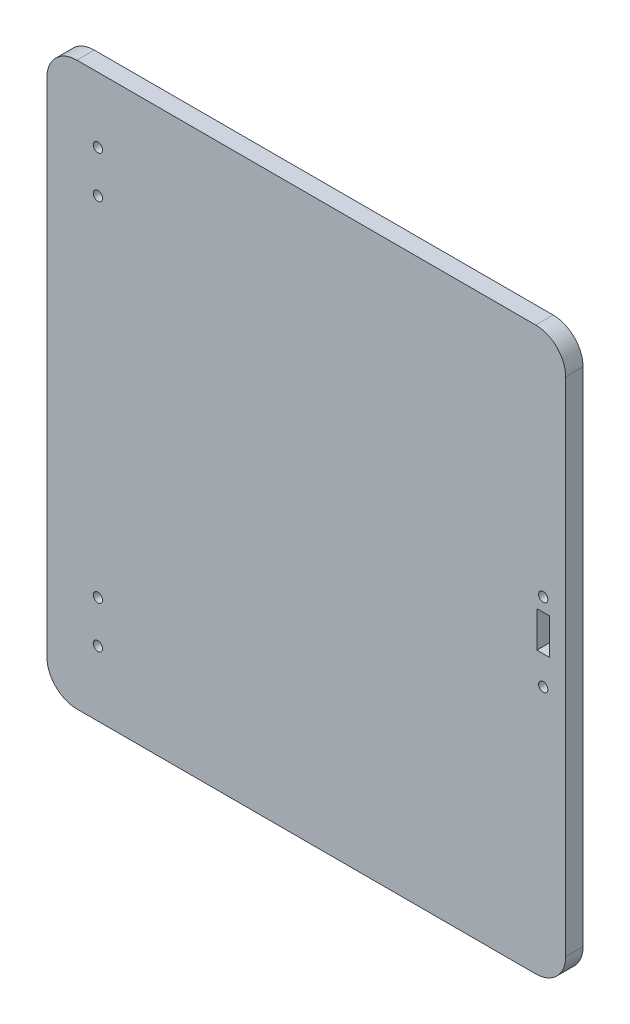
ISO-10303-21;
HEADER;
FILE_DESCRIPTION(('STEP AP214'),'2;1');
FILE_NAME('part.step','',(''),(''),'','','');
FILE_SCHEMA(('AUTOMOTIVE_DESIGN { 1 0 10303 214 1 1 1 1 }'));
ENDSEC;
DATA;
#1=APPLICATION_CONTEXT('core data for automotive mechanical design processes');
#2=APPLICATION_PROTOCOL_DEFINITION('international standard','automotive_design',2000,#1);
#3=PRODUCT_CONTEXT('',#1,'mechanical');
#4=PRODUCT('Part','Part','',(#3));
#5=PRODUCT_RELATED_PRODUCT_CATEGORY('part','',(#4));
#6=PRODUCT_DEFINITION_FORMATION('','',#4);
#7=PRODUCT_DEFINITION_CONTEXT('part definition',#1,'design');
#8=PRODUCT_DEFINITION('design','',#6,#7);
#9=PRODUCT_DEFINITION_SHAPE('','',#8);
#10=(LENGTH_UNIT() NAMED_UNIT(*) SI_UNIT(.MILLI.,.METRE.));
#11=(NAMED_UNIT(*) PLANE_ANGLE_UNIT() SI_UNIT($,.RADIAN.));
#12=(NAMED_UNIT(*) SI_UNIT($,.STERADIAN.) SOLID_ANGLE_UNIT());
#13=UNCERTAINTY_MEASURE_WITH_UNIT(LENGTH_MEASURE(1.E-05),#10,'distance_accuracy_value','');
#14=(GEOMETRIC_REPRESENTATION_CONTEXT(3) GLOBAL_UNCERTAINTY_ASSIGNED_CONTEXT((#13)) GLOBAL_UNIT_ASSIGNED_CONTEXT((#10,
#11,#12)) REPRESENTATION_CONTEXT('',''));
#15=CARTESIAN_POINT('',(0.,0.,0.));
#16=DIRECTION('',(0.,0.,1.));
#17=DIRECTION('',(1.,0.,0.));
#18=AXIS2_PLACEMENT_3D('',#15,#16,#17);
#19=CARTESIAN_POINT('',(76.5,83.7,5.8));
#20=DIRECTION('',(0.,0.,-1.));
#21=DIRECTION('',(-1.,0.,0.));
#22=AXIS2_PLACEMENT_3D('',#19,#20,#21);
#23=CYLINDRICAL_SURFACE('',#22,9.99999999999999);
#24=CARTESIAN_POINT('',(76.5,83.7,0.));
#25=DIRECTION('',(0.,0.,1.));
#26=DIRECTION('',(1.,0.,0.));
#27=AXIS2_PLACEMENT_3D('',#24,#25,#26);
#28=CIRCLE('',#27,9.99999999999999);
#29=CARTESIAN_POINT('',(86.5,83.7,0.));
#30=VERTEX_POINT('',#29);
#31=CARTESIAN_POINT('',(76.5,93.7,0.));
#32=VERTEX_POINT('',#31);
#33=EDGE_CURVE('E159',#30,#32,#28,.T.);
#34=ORIENTED_EDGE('',*,*,#33,.T.);
#35=DIRECTION('',(0.,0.,-1.));
#36=VECTOR('',#35,1.);
#37=CARTESIAN_POINT('',(76.5,93.7,5.8));
#38=LINE('',#37,#36);
#39=CARTESIAN_POINT('',(76.5,93.7,5.8));
#40=VERTEX_POINT('',#39);
#41=EDGE_CURVE('E241',#40,#32,#38,.T.);
#42=ORIENTED_EDGE('',*,*,#41,.F.);
#43=CARTESIAN_POINT('',(76.5,83.7,5.8));
#44=DIRECTION('',(0.,0.,1.));
#45=DIRECTION('',(1.,0.,0.));
#46=AXIS2_PLACEMENT_3D('',#43,#44,#45);
#47=CIRCLE('',#46,9.99999999999999);
#48=CARTESIAN_POINT('',(86.5,83.7,5.8));
#49=VERTEX_POINT('',#48);
#50=EDGE_CURVE('E164',#49,#40,#47,.T.);
#51=ORIENTED_EDGE('',*,*,#50,.F.);
#52=DIRECTION('',(0.,0.,-1.));
#53=VECTOR('',#52,1.);
#54=CARTESIAN_POINT('',(86.5,83.7,5.8));
#55=LINE('',#54,#53);
#56=EDGE_CURVE('E190',#49,#30,#55,.T.);
#57=ORIENTED_EDGE('',*,*,#56,.T.);
#58=EDGE_LOOP('',(#34,#42,#51,#57));
#59=FACE_BOUND('',#58,.T.);
#60=ADVANCED_FACE('F39',(#59),#23,.T.);
#61=CARTESIAN_POINT('',(76.5,93.7,5.8));
#62=DIRECTION('',(0.,-1.,0.));
#63=DIRECTION('',(0.,0.,-1.));
#64=AXIS2_PLACEMENT_3D('',#61,#62,#63);
#65=PLANE('',#64);
#66=DIRECTION('',(-1.,0.,0.));
#67=VECTOR('',#66,1.);
#68=CARTESIAN_POINT('',(76.5,93.7,0.));
#69=LINE('',#68,#67);
#70=CARTESIAN_POINT('',(-76.5,93.7,0.));
#71=VERTEX_POINT('',#70);
#72=EDGE_CURVE('E194',#32,#71,#69,.T.);
#73=ORIENTED_EDGE('',*,*,#72,.T.);
#74=DIRECTION('',(0.,0.,-1.));
#75=VECTOR('',#74,1.);
#76=CARTESIAN_POINT('',(-76.5,93.7,5.8));
#77=LINE('',#76,#75);
#78=CARTESIAN_POINT('',(-76.5,93.7,5.8));
#79=VERTEX_POINT('',#78);
#80=EDGE_CURVE('E237',#79,#71,#77,.T.);
#81=ORIENTED_EDGE('',*,*,#80,.F.);
#82=DIRECTION('',(-1.,0.,0.));
#83=VECTOR('',#82,1.);
#84=CARTESIAN_POINT('',(76.5,93.7,5.8));
#85=LINE('',#84,#83);
#86=EDGE_CURVE('E168',#40,#79,#85,.T.);
#87=ORIENTED_EDGE('',*,*,#86,.F.);
#88=ORIENTED_EDGE('',*,*,#41,.T.);
#89=EDGE_LOOP('',(#73,#81,#87,#88));
#90=FACE_BOUND('',#89,.T.);
#91=ADVANCED_FACE('F270',(#90),#65,.F.);
#92=CARTESIAN_POINT('',(-76.5,83.7,5.8));
#93=DIRECTION('',(0.,0.,-1.));
#94=DIRECTION('',(-1.,0.,0.));
#95=AXIS2_PLACEMENT_3D('',#92,#93,#94);
#96=CYLINDRICAL_SURFACE('',#95,9.99999999999999);
#97=CARTESIAN_POINT('',(-76.5,83.7,0.));
#98=DIRECTION('',(0.,0.,1.));
#99=DIRECTION('',(1.,0.,0.));
#100=AXIS2_PLACEMENT_3D('',#97,#98,#99);
#101=CIRCLE('',#100,9.99999999999999);
#102=CARTESIAN_POINT('',(-86.5,83.7,0.));
#103=VERTEX_POINT('',#102);
#104=EDGE_CURVE('E197',#71,#103,#101,.T.);
#105=ORIENTED_EDGE('',*,*,#104,.T.);
#106=DIRECTION('',(0.,0.,-1.));
#107=VECTOR('',#106,1.);
#108=CARTESIAN_POINT('',(-86.5,83.7,5.8));
#109=LINE('',#108,#107);
#110=CARTESIAN_POINT('',(-86.5,83.7,5.8));
#111=VERTEX_POINT('',#110);
#112=EDGE_CURVE('E233',#111,#103,#109,.T.);
#113=ORIENTED_EDGE('',*,*,#112,.F.);
#114=CARTESIAN_POINT('',(-76.5,83.7,5.8));
#115=DIRECTION('',(0.,0.,1.));
#116=DIRECTION('',(1.,0.,0.));
#117=AXIS2_PLACEMENT_3D('',#114,#115,#116);
#118=CIRCLE('',#117,9.99999999999999);
#119=EDGE_CURVE('E172',#79,#111,#118,.T.);
#120=ORIENTED_EDGE('',*,*,#119,.F.);
#121=ORIENTED_EDGE('',*,*,#80,.T.);
#122=EDGE_LOOP('',(#105,#113,#120,#121));
#123=FACE_BOUND('',#122,.T.);
#124=ADVANCED_FACE('F275',(#123),#96,.T.);
#125=CARTESIAN_POINT('',(-86.5,83.7,5.8));
#126=DIRECTION('',(1.,0.,0.));
#127=DIRECTION('',(0.,0.,-1.));
#128=AXIS2_PLACEMENT_3D('',#125,#126,#127);
#129=PLANE('',#128);
#130=DIRECTION('',(0.,-1.,0.));
#131=VECTOR('',#130,1.);
#132=CARTESIAN_POINT('',(-86.5,83.7,0.));
#133=LINE('',#132,#131);
#134=CARTESIAN_POINT('',(-86.5,-83.7,0.));
#135=VERTEX_POINT('',#134);
#136=EDGE_CURVE('E200',#103,#135,#133,.T.);
#137=ORIENTED_EDGE('',*,*,#136,.T.);
#138=DIRECTION('',(0.,0.,-1.));
#139=VECTOR('',#138,1.);
#140=CARTESIAN_POINT('',(-86.5,-83.7,5.8));
#141=LINE('',#140,#139);
#142=CARTESIAN_POINT('',(-86.5,-83.7,5.8));
#143=VERTEX_POINT('',#142);
#144=EDGE_CURVE('E229',#143,#135,#141,.T.);
#145=ORIENTED_EDGE('',*,*,#144,.F.);
#146=DIRECTION('',(0.,-1.,0.));
#147=VECTOR('',#146,1.);
#148=CARTESIAN_POINT('',(-86.5,83.7,5.8));
#149=LINE('',#148,#147);
#150=EDGE_CURVE('E175',#111,#143,#149,.T.);
#151=ORIENTED_EDGE('',*,*,#150,.F.);
#152=ORIENTED_EDGE('',*,*,#112,.T.);
#153=EDGE_LOOP('',(#137,#145,#151,#152));
#154=FACE_BOUND('',#153,.T.);
#155=ADVANCED_FACE('F307',(#154),#129,.F.);
#156=CARTESIAN_POINT('',(-76.5,-83.7,5.8));
#157=DIRECTION('',(0.,0.,-1.));
#158=DIRECTION('',(-1.,0.,0.));
#159=AXIS2_PLACEMENT_3D('',#156,#157,#158);
#160=CYLINDRICAL_SURFACE('',#159,9.99999999999999);
#161=CARTESIAN_POINT('',(-76.5,-83.7,0.));
#162=DIRECTION('',(0.,0.,1.));
#163=DIRECTION('',(1.,0.,0.));
#164=AXIS2_PLACEMENT_3D('',#161,#162,#163);
#165=CIRCLE('',#164,9.99999999999999);
#166=CARTESIAN_POINT('',(-76.5,-93.7,0.));
#167=VERTEX_POINT('',#166);
#168=EDGE_CURVE('E203',#135,#167,#165,.T.);
#169=ORIENTED_EDGE('',*,*,#168,.T.);
#170=DIRECTION('',(0.,0.,-1.));
#171=VECTOR('',#170,1.);
#172=CARTESIAN_POINT('',(-76.5,-93.7,5.8));
#173=LINE('',#172,#171);
#174=CARTESIAN_POINT('',(-76.5,-93.7,5.8));
#175=VERTEX_POINT('',#174);
#176=EDGE_CURVE('E225',#175,#167,#173,.T.);
#177=ORIENTED_EDGE('',*,*,#176,.F.);
#178=CARTESIAN_POINT('',(-76.5,-83.7,5.8));
#179=DIRECTION('',(0.,0.,1.));
#180=DIRECTION('',(1.,0.,0.));
#181=AXIS2_PLACEMENT_3D('',#178,#179,#180);
#182=CIRCLE('',#181,9.99999999999999);
#183=EDGE_CURVE('E178',#143,#175,#182,.T.);
#184=ORIENTED_EDGE('',*,*,#183,.F.);
#185=ORIENTED_EDGE('',*,*,#144,.T.);
#186=EDGE_LOOP('',(#169,#177,#184,#185));
#187=FACE_BOUND('',#186,.T.);
#188=ADVANCED_FACE('F303',(#187),#160,.T.);
#189=CARTESIAN_POINT('',(76.5,-93.7,5.8));
#190=DIRECTION('',(0.,1.,0.));
#191=DIRECTION('',(0.,0.,1.));
#192=AXIS2_PLACEMENT_3D('',#189,#190,#191);
#193=PLANE('',#192);
#194=DIRECTION('',(1.,0.,0.));
#195=VECTOR('',#194,1.);
#196=CARTESIAN_POINT('',(76.5,-93.7,0.));
#197=LINE('',#196,#195);
#198=CARTESIAN_POINT('',(76.5,-93.7,0.));
#199=VERTEX_POINT('',#198);
#200=EDGE_CURVE('E206',#167,#199,#197,.T.);
#201=ORIENTED_EDGE('',*,*,#200,.T.);
#202=DIRECTION('',(0.,0.,-1.));
#203=VECTOR('',#202,1.);
#204=CARTESIAN_POINT('',(76.5,-93.7,5.8));
#205=LINE('',#204,#203);
#206=CARTESIAN_POINT('',(76.5,-93.7,5.8));
#207=VERTEX_POINT('',#206);
#208=EDGE_CURVE('E221',#207,#199,#205,.T.);
#209=ORIENTED_EDGE('',*,*,#208,.F.);
#210=DIRECTION('',(1.,0.,0.));
#211=VECTOR('',#210,1.);
#212=CARTESIAN_POINT('',(76.5,-93.7,5.8));
#213=LINE('',#212,#211);
#214=EDGE_CURVE('E181',#175,#207,#213,.T.);
#215=ORIENTED_EDGE('',*,*,#214,.F.);
#216=ORIENTED_EDGE('',*,*,#176,.T.);
#217=EDGE_LOOP('',(#201,#209,#215,#216));
#218=FACE_BOUND('',#217,.T.);
#219=ADVANCED_FACE('F298',(#218),#193,.F.);
#220=CARTESIAN_POINT('',(76.5,-83.7,5.8));
#221=DIRECTION('',(0.,0.,-1.));
#222=DIRECTION('',(-1.,0.,0.));
#223=AXIS2_PLACEMENT_3D('',#220,#221,#222);
#224=CYLINDRICAL_SURFACE('',#223,9.99999999999999);
#225=CARTESIAN_POINT('',(76.5,-83.7,0.));
#226=DIRECTION('',(0.,0.,1.));
#227=DIRECTION('',(1.,0.,0.));
#228=AXIS2_PLACEMENT_3D('',#225,#226,#227);
#229=CIRCLE('',#228,9.99999999999999);
#230=CARTESIAN_POINT('',(86.5,-83.7,0.));
#231=VERTEX_POINT('',#230);
#232=EDGE_CURVE('E209',#199,#231,#229,.T.);
#233=ORIENTED_EDGE('',*,*,#232,.T.);
#234=DIRECTION('',(0.,0.,-1.));
#235=VECTOR('',#234,1.);
#236=CARTESIAN_POINT('',(86.5,-83.7,5.8));
#237=LINE('',#236,#235);
#238=CARTESIAN_POINT('',(86.5,-83.7,5.8));
#239=VERTEX_POINT('',#238);
#240=EDGE_CURVE('E217',#239,#231,#237,.T.);
#241=ORIENTED_EDGE('',*,*,#240,.F.);
#242=CARTESIAN_POINT('',(76.5,-83.7,5.8));
#243=DIRECTION('',(0.,0.,1.));
#244=DIRECTION('',(1.,0.,0.));
#245=AXIS2_PLACEMENT_3D('',#242,#243,#244);
#246=CIRCLE('',#245,9.99999999999999);
#247=EDGE_CURVE('E184',#207,#239,#246,.T.);
#248=ORIENTED_EDGE('',*,*,#247,.F.);
#249=ORIENTED_EDGE('',*,*,#208,.T.);
#250=EDGE_LOOP('',(#233,#241,#248,#249));
#251=FACE_BOUND('',#250,.T.);
#252=ADVANCED_FACE('F293',(#251),#224,.T.);
#253=CARTESIAN_POINT('',(86.5,83.7,5.8));
#254=DIRECTION('',(-1.,0.,0.));
#255=DIRECTION('',(0.,0.,1.));
#256=AXIS2_PLACEMENT_3D('',#253,#254,#255);
#257=PLANE('',#256);
#258=DIRECTION('',(0.,1.,0.));
#259=VECTOR('',#258,1.);
#260=CARTESIAN_POINT('',(86.5,83.7,0.));
#261=LINE('',#260,#259);
#262=EDGE_CURVE('E169',#231,#30,#261,.T.);
#263=ORIENTED_EDGE('',*,*,#262,.T.);
#264=ORIENTED_EDGE('',*,*,#56,.F.);
#265=DIRECTION('',(0.,1.,0.));
#266=VECTOR('',#265,1.);
#267=CARTESIAN_POINT('',(86.5,83.7,5.8));
#268=LINE('',#267,#266);
#269=EDGE_CURVE('E187',#239,#49,#268,.T.);
#270=ORIENTED_EDGE('',*,*,#269,.F.);
#271=ORIENTED_EDGE('',*,*,#240,.T.);
#272=EDGE_LOOP('',(#263,#264,#270,#271));
#273=FACE_BOUND('',#272,.T.);
#274=ADVANCED_FACE('F291',(#273),#257,.F.);
#275=CARTESIAN_POINT('',(76.5,83.7,5.8));
#276=DIRECTION('',(0.,0.,1.));
#277=DIRECTION('',(1.,0.,0.));
#278=AXIS2_PLACEMENT_3D('',#275,#276,#277);
#279=PLANE('',#278);
#280=CARTESIAN_POINT('',(79.,16.45,5.8));
#281=DIRECTION('',(0.,0.,1.));
#282=DIRECTION('',(1.,0.,0.));
#283=AXIS2_PLACEMENT_3D('',#280,#281,#282);
#284=CIRCLE('',#283,1.54999999999999);
#285=CARTESIAN_POINT('',(80.55,16.45,5.8));
#286=VERTEX_POINT('',#285);
#287=EDGE_CURVE('E331',#286,#286,#284,.T.);
#288=ORIENTED_EDGE('',*,*,#287,.F.);
#289=EDGE_LOOP('',(#288));
#290=FACE_BOUND('',#289,.T.);
#291=CARTESIAN_POINT('',(79.,-9.55,5.8));
#292=DIRECTION('',(0.,0.,1.));
#293=DIRECTION('',(1.,0.,0.));
#294=AXIS2_PLACEMENT_3D('',#291,#292,#293);
#295=CIRCLE('',#294,1.54999999999999);
#296=CARTESIAN_POINT('',(80.55,-9.55,5.8));
#297=VERTEX_POINT('',#296);
#298=EDGE_CURVE('E335',#297,#297,#295,.T.);
#299=ORIENTED_EDGE('',*,*,#298,.F.);
#300=EDGE_LOOP('',(#299));
#301=FACE_BOUND('',#300,.T.);
#302=CARTESIAN_POINT('',(-69.5,72.,5.8));
#303=DIRECTION('',(0.,0.,1.));
#304=DIRECTION('',(1.,0.,0.));
#305=AXIS2_PLACEMENT_3D('',#302,#303,#304);
#306=CIRCLE('',#305,1.54999999999999);
#307=CARTESIAN_POINT('',(-67.95,72.,5.8));
#308=VERTEX_POINT('',#307);
#309=EDGE_CURVE('E339',#308,#308,#306,.T.);
#310=ORIENTED_EDGE('',*,*,#309,.F.);
#311=EDGE_LOOP('',(#310));
#312=FACE_BOUND('',#311,.T.);
#313=CARTESIAN_POINT('',(-69.5,58.,5.8));
#314=DIRECTION('',(0.,0.,1.));
#315=DIRECTION('',(1.,0.,0.));
#316=AXIS2_PLACEMENT_3D('',#313,#314,#315);
#317=CIRCLE('',#316,1.54999999999999);
#318=CARTESIAN_POINT('',(-67.95,58.,5.8));
#319=VERTEX_POINT('',#318);
#320=EDGE_CURVE('E343',#319,#319,#317,.T.);
#321=ORIENTED_EDGE('',*,*,#320,.F.);
#322=EDGE_LOOP('',(#321));
#323=FACE_BOUND('',#322,.T.);
#324=CARTESIAN_POINT('',(-69.5,-58.,5.8));
#325=DIRECTION('',(0.,0.,1.));
#326=DIRECTION('',(-1.,0.,0.));
#327=AXIS2_PLACEMENT_3D('',#324,#325,#326);
#328=CIRCLE('',#327,1.54999999999999);
#329=CARTESIAN_POINT('',(-71.05,-58.,5.8));
#330=VERTEX_POINT('',#329);
#331=EDGE_CURVE('E347',#330,#330,#328,.T.);
#332=ORIENTED_EDGE('',*,*,#331,.F.);
#333=EDGE_LOOP('',(#332));
#334=FACE_BOUND('',#333,.T.);
#335=CARTESIAN_POINT('',(-69.5,-72.,5.8));
#336=DIRECTION('',(0.,0.,1.));
#337=DIRECTION('',(-1.,0.,0.));
#338=AXIS2_PLACEMENT_3D('',#335,#336,#337);
#339=CIRCLE('',#338,1.54999999999999);
#340=CARTESIAN_POINT('',(-71.05,-72.,5.8));
#341=VERTEX_POINT('',#340);
#342=EDGE_CURVE('E350',#341,#341,#339,.T.);
#343=ORIENTED_EDGE('',*,*,#342,.F.);
#344=EDGE_LOOP('',(#343));
#345=FACE_BOUND('',#344,.T.);
#346=DIRECTION('',(0.,1.,0.));
#347=VECTOR('',#346,1.);
#348=CARTESIAN_POINT('',(81.1,0.,5.8));
#349=LINE('',#348,#347);
#350=CARTESIAN_POINT('',(81.1,0.,5.8));
#351=VERTEX_POINT('',#350);
#352=CARTESIAN_POINT('',(81.1,12.,5.8));
#353=VERTEX_POINT('',#352);
#354=EDGE_CURVE('E54',#351,#353,#349,.T.);
#355=ORIENTED_EDGE('',*,*,#354,.F.);
#356=DIRECTION('',(1.,0.,0.));
#357=VECTOR('',#356,1.);
#358=CARTESIAN_POINT('',(81.1,0.,5.8));
#359=LINE('',#358,#357);
#360=CARTESIAN_POINT('',(76.9,0.,5.8));
#361=VERTEX_POINT('',#360);
#362=EDGE_CURVE('E149',#361,#351,#359,.T.);
#363=ORIENTED_EDGE('',*,*,#362,.F.);
#364=DIRECTION('',(0.,-1.,0.));
#365=VECTOR('',#364,1.);
#366=CARTESIAN_POINT('',(76.9,0.,5.8));
#367=LINE('',#366,#365);
#368=CARTESIAN_POINT('',(76.9,12.,5.8));
#369=VERTEX_POINT('',#368);
#370=EDGE_CURVE('E131',#369,#361,#367,.T.);
#371=ORIENTED_EDGE('',*,*,#370,.F.);
#372=DIRECTION('',(-1.,0.,0.));
#373=VECTOR('',#372,1.);
#374=CARTESIAN_POINT('',(81.1,12.,5.8));
#375=LINE('',#374,#373);
#376=EDGE_CURVE('E141',#353,#369,#375,.T.);
#377=ORIENTED_EDGE('',*,*,#376,.F.);
#378=EDGE_LOOP('',(#355,#363,#371,#377));
#379=FACE_BOUND('',#378,.T.);
#380=ORIENTED_EDGE('',*,*,#50,.T.);
#381=ORIENTED_EDGE('',*,*,#86,.T.);
#382=ORIENTED_EDGE('',*,*,#119,.T.);
#383=ORIENTED_EDGE('',*,*,#150,.T.);
#384=ORIENTED_EDGE('',*,*,#183,.T.);
#385=ORIENTED_EDGE('',*,*,#214,.T.);
#386=ORIENTED_EDGE('',*,*,#247,.T.);
#387=ORIENTED_EDGE('',*,*,#269,.T.);
#388=EDGE_LOOP('',(#380,#381,#382,#383,#384,#385,#386,#387));
#389=FACE_BOUND('',#388,.T.);
#390=ADVANCED_FACE('F146',(#290,#301,#312,#323,#334,#345,#379,#389),#279,.T.);
#391=CARTESIAN_POINT('',(76.5,83.7,0.));
#392=DIRECTION('',(0.,0.,1.));
#393=DIRECTION('',(1.,0.,0.));
#394=AXIS2_PLACEMENT_3D('',#391,#392,#393);
#395=PLANE('',#394);
#396=CARTESIAN_POINT('',(79.,16.45,0.));
#397=DIRECTION('',(0.,0.,1.));
#398=DIRECTION('',(1.,0.,0.));
#399=AXIS2_PLACEMENT_3D('',#396,#397,#398);
#400=CIRCLE('',#399,1.54999999999999);
#401=CARTESIAN_POINT('',(80.55,16.45,0.));
#402=VERTEX_POINT('',#401);
#403=EDGE_CURVE('E354',#402,#402,#400,.T.);
#404=ORIENTED_EDGE('',*,*,#403,.T.);
#405=EDGE_LOOP('',(#404));
#406=FACE_BOUND('',#405,.T.);
#407=CARTESIAN_POINT('',(79.,-9.55,0.));
#408=DIRECTION('',(0.,0.,1.));
#409=DIRECTION('',(1.,0.,0.));
#410=AXIS2_PLACEMENT_3D('',#407,#408,#409);
#411=CIRCLE('',#410,1.54999999999999);
#412=CARTESIAN_POINT('',(80.55,-9.55,0.));
#413=VERTEX_POINT('',#412);
#414=EDGE_CURVE('E471',#413,#413,#411,.T.);
#415=ORIENTED_EDGE('',*,*,#414,.T.);
#416=EDGE_LOOP('',(#415));
#417=FACE_BOUND('',#416,.T.);
#418=CARTESIAN_POINT('',(-69.5,72.,0.));
#419=DIRECTION('',(0.,0.,1.));
#420=DIRECTION('',(1.,0.,0.));
#421=AXIS2_PLACEMENT_3D('',#418,#419,#420);
#422=CIRCLE('',#421,1.54999999999999);
#423=CARTESIAN_POINT('',(-67.95,72.,0.));
#424=VERTEX_POINT('',#423);
#425=EDGE_CURVE('E364',#424,#424,#422,.T.);
#426=ORIENTED_EDGE('',*,*,#425,.T.);
#427=EDGE_LOOP('',(#426));
#428=FACE_BOUND('',#427,.T.);
#429=CARTESIAN_POINT('',(-69.5,58.,0.));
#430=DIRECTION('',(0.,0.,1.));
#431=DIRECTION('',(1.,0.,0.));
#432=AXIS2_PLACEMENT_3D('',#429,#430,#431);
#433=CIRCLE('',#432,1.54999999999999);
#434=CARTESIAN_POINT('',(-67.95,58.,0.));
#435=VERTEX_POINT('',#434);
#436=EDGE_CURVE('E371',#435,#435,#433,.T.);
#437=ORIENTED_EDGE('',*,*,#436,.T.);
#438=EDGE_LOOP('',(#437));
#439=FACE_BOUND('',#438,.T.);
#440=CARTESIAN_POINT('',(-69.5,-58.,0.));
#441=DIRECTION('',(0.,0.,1.));
#442=DIRECTION('',(-1.,0.,0.));
#443=AXIS2_PLACEMENT_3D('',#440,#441,#442);
#444=CIRCLE('',#443,1.54999999999999);
#445=CARTESIAN_POINT('',(-71.05,-58.,0.));
#446=VERTEX_POINT('',#445);
#447=EDGE_CURVE('E381',#446,#446,#444,.T.);
#448=ORIENTED_EDGE('',*,*,#447,.T.);
#449=EDGE_LOOP('',(#448));
#450=FACE_BOUND('',#449,.T.);
#451=CARTESIAN_POINT('',(-69.5,-72.,0.));
#452=DIRECTION('',(0.,0.,1.));
#453=DIRECTION('',(-1.,0.,0.));
#454=AXIS2_PLACEMENT_3D('',#451,#452,#453);
#455=CIRCLE('',#454,1.54999999999999);
#456=CARTESIAN_POINT('',(-71.05,-72.,0.));
#457=VERTEX_POINT('',#456);
#458=EDGE_CURVE('E353',#457,#457,#455,.T.);
#459=ORIENTED_EDGE('',*,*,#458,.T.);
#460=EDGE_LOOP('',(#459));
#461=FACE_BOUND('',#460,.T.);
#462=DIRECTION('',(1.,0.,0.));
#463=VECTOR('',#462,1.);
#464=CARTESIAN_POINT('',(76.5,0.,0.));
#465=LINE('',#464,#463);
#466=CARTESIAN_POINT('',(76.9,0.,0.));
#467=VERTEX_POINT('',#466);
#468=CARTESIAN_POINT('',(81.1,0.,0.));
#469=VERTEX_POINT('',#468);
#470=EDGE_CURVE('E47',#467,#469,#465,.T.);
#471=ORIENTED_EDGE('',*,*,#470,.T.);
#472=DIRECTION('',(0.,1.,0.));
#473=VECTOR('',#472,1.);
#474=CARTESIAN_POINT('',(81.1000000000002,83.7,0.));
#475=LINE('',#474,#473);
#476=CARTESIAN_POINT('',(81.1,12.,0.));
#477=VERTEX_POINT('',#476);
#478=EDGE_CURVE('E11',#469,#477,#475,.T.);
#479=ORIENTED_EDGE('',*,*,#478,.T.);
#480=DIRECTION('',(-1.,0.,0.));
#481=VECTOR('',#480,1.);
#482=CARTESIAN_POINT('',(76.5,12.,0.));
#483=LINE('',#482,#481);
#484=CARTESIAN_POINT('',(76.9,12.,0.));
#485=VERTEX_POINT('',#484);
#486=EDGE_CURVE('E245',#477,#485,#483,.T.);
#487=ORIENTED_EDGE('',*,*,#486,.T.);
#488=DIRECTION('',(0.,-1.,0.));
#489=VECTOR('',#488,1.);
#490=CARTESIAN_POINT('',(76.9,83.7,0.));
#491=LINE('',#490,#489);
#492=EDGE_CURVE('E134',#485,#467,#491,.T.);
#493=ORIENTED_EDGE('',*,*,#492,.T.);
#494=EDGE_LOOP('',(#471,#479,#487,#493));
#495=FACE_BOUND('',#494,.T.);
#496=ORIENTED_EDGE('',*,*,#33,.F.);
#497=ORIENTED_EDGE('',*,*,#262,.F.);
#498=ORIENTED_EDGE('',*,*,#232,.F.);
#499=ORIENTED_EDGE('',*,*,#200,.F.);
#500=ORIENTED_EDGE('',*,*,#168,.F.);
#501=ORIENTED_EDGE('',*,*,#136,.F.);
#502=ORIENTED_EDGE('',*,*,#104,.F.);
#503=ORIENTED_EDGE('',*,*,#72,.F.);
#504=EDGE_LOOP('',(#496,#497,#498,#499,#500,#501,#502,#503));
#505=FACE_BOUND('',#504,.T.);
#506=ADVANCED_FACE('F252',(#406,#417,#428,#439,#450,#461,#495,#505),#395,.F.);
#507=CARTESIAN_POINT('',(81.1,0.,-0.55));
#508=DIRECTION('',(1.,0.,0.));
#509=DIRECTION('',(0.,1.,0.));
#510=AXIS2_PLACEMENT_3D('',#507,#508,#509);
#511=PLANE('',#510);
#512=DIRECTION('',(0.,0.,1.));
#513=VECTOR('',#512,1.);
#514=CARTESIAN_POINT('',(81.1,0.,-0.55));
#515=LINE('',#514,#513);
#516=EDGE_CURVE('E156',#469,#351,#515,.T.);
#517=ORIENTED_EDGE('',*,*,#516,.T.);
#518=ORIENTED_EDGE('',*,*,#354,.T.);
#519=DIRECTION('',(0.,0.,1.));
#520=VECTOR('',#519,1.);
#521=CARTESIAN_POINT('',(81.1,12.,-0.55));
#522=LINE('',#521,#520);
#523=EDGE_CURVE('E138',#477,#353,#522,.T.);
#524=ORIENTED_EDGE('',*,*,#523,.F.);
#525=ORIENTED_EDGE('',*,*,#478,.F.);
#526=EDGE_LOOP('',(#517,#518,#524,#525));
#527=FACE_BOUND('',#526,.T.);
#528=ADVANCED_FACE('F257',(#527),#511,.F.);
#529=CARTESIAN_POINT('',(81.1,0.,-0.55));
#530=DIRECTION('',(0.,-1.,0.));
#531=DIRECTION('',(1.,0.,0.));
#532=AXIS2_PLACEMENT_3D('',#529,#530,#531);
#533=PLANE('',#532);
#534=DIRECTION('',(0.,0.,1.));
#535=VECTOR('',#534,1.);
#536=CARTESIAN_POINT('',(76.9,0.,-0.55));
#537=LINE('',#536,#535);
#538=EDGE_CURVE('E137',#467,#361,#537,.T.);
#539=ORIENTED_EDGE('',*,*,#538,.T.);
#540=ORIENTED_EDGE('',*,*,#362,.T.);
#541=ORIENTED_EDGE('',*,*,#516,.F.);
#542=ORIENTED_EDGE('',*,*,#470,.F.);
#543=EDGE_LOOP('',(#539,#540,#541,#542));
#544=FACE_BOUND('',#543,.T.);
#545=ADVANCED_FACE('F256',(#544),#533,.F.);
#546=CARTESIAN_POINT('',(76.9,0.,-0.55));
#547=DIRECTION('',(-1.,0.,0.));
#548=DIRECTION('',(0.,0.,1.));
#549=AXIS2_PLACEMENT_3D('',#546,#547,#548);
#550=PLANE('',#549);
#551=DIRECTION('',(0.,0.,1.));
#552=VECTOR('',#551,1.);
#553=CARTESIAN_POINT('',(76.9,12.,-0.55));
#554=LINE('',#553,#552);
#555=EDGE_CURVE('E62',#485,#369,#554,.T.);
#556=ORIENTED_EDGE('',*,*,#555,.T.);
#557=ORIENTED_EDGE('',*,*,#370,.T.);
#558=ORIENTED_EDGE('',*,*,#538,.F.);
#559=ORIENTED_EDGE('',*,*,#492,.F.);
#560=EDGE_LOOP('',(#556,#557,#558,#559));
#561=FACE_BOUND('',#560,.T.);
#562=ADVANCED_FACE('F128',(#561),#550,.F.);
#563=CARTESIAN_POINT('',(81.1,12.,-0.55));
#564=DIRECTION('',(0.,1.,0.));
#565=DIRECTION('',(0.,0.,1.));
#566=AXIS2_PLACEMENT_3D('',#563,#564,#565);
#567=PLANE('',#566);
#568=ORIENTED_EDGE('',*,*,#523,.T.);
#569=ORIENTED_EDGE('',*,*,#376,.T.);
#570=ORIENTED_EDGE('',*,*,#555,.F.);
#571=ORIENTED_EDGE('',*,*,#486,.F.);
#572=EDGE_LOOP('',(#568,#569,#570,#571));
#573=FACE_BOUND('',#572,.T.);
#574=ADVANCED_FACE('F142',(#573),#567,.F.);
#575=CARTESIAN_POINT('',(-69.5,-72.,0.));
#576=DIRECTION('',(0.,0.,1.));
#577=DIRECTION('',(1.,0.,0.));
#578=AXIS2_PLACEMENT_3D('',#575,#576,#577);
#579=CYLINDRICAL_SURFACE('',#578,1.54999999999999);
#580=ORIENTED_EDGE('',*,*,#458,.F.);
#581=EDGE_LOOP('',(#580));
#582=FACE_BOUND('',#581,.T.);
#583=ORIENTED_EDGE('',*,*,#342,.T.);
#584=EDGE_LOOP('',(#583));
#585=FACE_BOUND('',#584,.T.);
#586=ADVANCED_FACE('F389',(#582,#585),#579,.F.);
#587=CARTESIAN_POINT('',(-69.5,-58.,0.));
#588=DIRECTION('',(0.,0.,1.));
#589=DIRECTION('',(1.,0.,0.));
#590=AXIS2_PLACEMENT_3D('',#587,#588,#589);
#591=CYLINDRICAL_SURFACE('',#590,1.54999999999999);
#592=ORIENTED_EDGE('',*,*,#447,.F.);
#593=EDGE_LOOP('',(#592));
#594=FACE_BOUND('',#593,.T.);
#595=ORIENTED_EDGE('',*,*,#331,.T.);
#596=EDGE_LOOP('',(#595));
#597=FACE_BOUND('',#596,.T.);
#598=ADVANCED_FACE('F386',(#594,#597),#591,.F.);
#599=CARTESIAN_POINT('',(-69.5,58.,0.));
#600=DIRECTION('',(0.,0.,1.));
#601=DIRECTION('',(1.,0.,0.));
#602=AXIS2_PLACEMENT_3D('',#599,#600,#601);
#603=CYLINDRICAL_SURFACE('',#602,1.54999999999999);
#604=ORIENTED_EDGE('',*,*,#436,.F.);
#605=EDGE_LOOP('',(#604));
#606=FACE_BOUND('',#605,.T.);
#607=ORIENTED_EDGE('',*,*,#320,.T.);
#608=EDGE_LOOP('',(#607));
#609=FACE_BOUND('',#608,.T.);
#610=ADVANCED_FACE('F388',(#606,#609),#603,.F.);
#611=CARTESIAN_POINT('',(-69.5,72.,0.));
#612=DIRECTION('',(0.,0.,1.));
#613=DIRECTION('',(1.,0.,0.));
#614=AXIS2_PLACEMENT_3D('',#611,#612,#613);
#615=CYLINDRICAL_SURFACE('',#614,1.54999999999999);
#616=ORIENTED_EDGE('',*,*,#425,.F.);
#617=EDGE_LOOP('',(#616));
#618=FACE_BOUND('',#617,.T.);
#619=ORIENTED_EDGE('',*,*,#309,.T.);
#620=EDGE_LOOP('',(#619));
#621=FACE_BOUND('',#620,.T.);
#622=ADVANCED_FACE('F396',(#618,#621),#615,.F.);
#623=CARTESIAN_POINT('',(79.,-9.55,0.));
#624=DIRECTION('',(0.,0.,1.));
#625=DIRECTION('',(1.,0.,0.));
#626=AXIS2_PLACEMENT_3D('',#623,#624,#625);
#627=CYLINDRICAL_SURFACE('',#626,1.54999999999999);
#628=ORIENTED_EDGE('',*,*,#414,.F.);
#629=EDGE_LOOP('',(#628));
#630=FACE_BOUND('',#629,.T.);
#631=ORIENTED_EDGE('',*,*,#298,.T.);
#632=EDGE_LOOP('',(#631));
#633=FACE_BOUND('',#632,.T.);
#634=ADVANCED_FACE('F432',(#630,#633),#627,.F.);
#635=CARTESIAN_POINT('',(79.,16.45,0.));
#636=DIRECTION('',(0.,0.,1.));
#637=DIRECTION('',(1.,0.,0.));
#638=AXIS2_PLACEMENT_3D('',#635,#636,#637);
#639=CYLINDRICAL_SURFACE('',#638,1.54999999999999);
#640=ORIENTED_EDGE('',*,*,#403,.F.);
#641=EDGE_LOOP('',(#640));
#642=FACE_BOUND('',#641,.T.);
#643=ORIENTED_EDGE('',*,*,#287,.T.);
#644=EDGE_LOOP('',(#643));
#645=FACE_BOUND('',#644,.T.);
#646=ADVANCED_FACE('F454',(#642,#645),#639,.F.);
#647=CLOSED_SHELL('',(#60,#91,#124,#155,#188,#219,#252,#274,#390,#506,#528,#545,#562,#574,#586,
#598,#610,#622,#634,#646));
#648=MANIFOLD_SOLID_BREP('B2',#647);
#649=ADVANCED_BREP_SHAPE_REPRESENTATION('',(#18,#648),#14);
#650=SHAPE_DEFINITION_REPRESENTATION(#9,#649);
ENDSEC;
END-ISO-10303-21;
